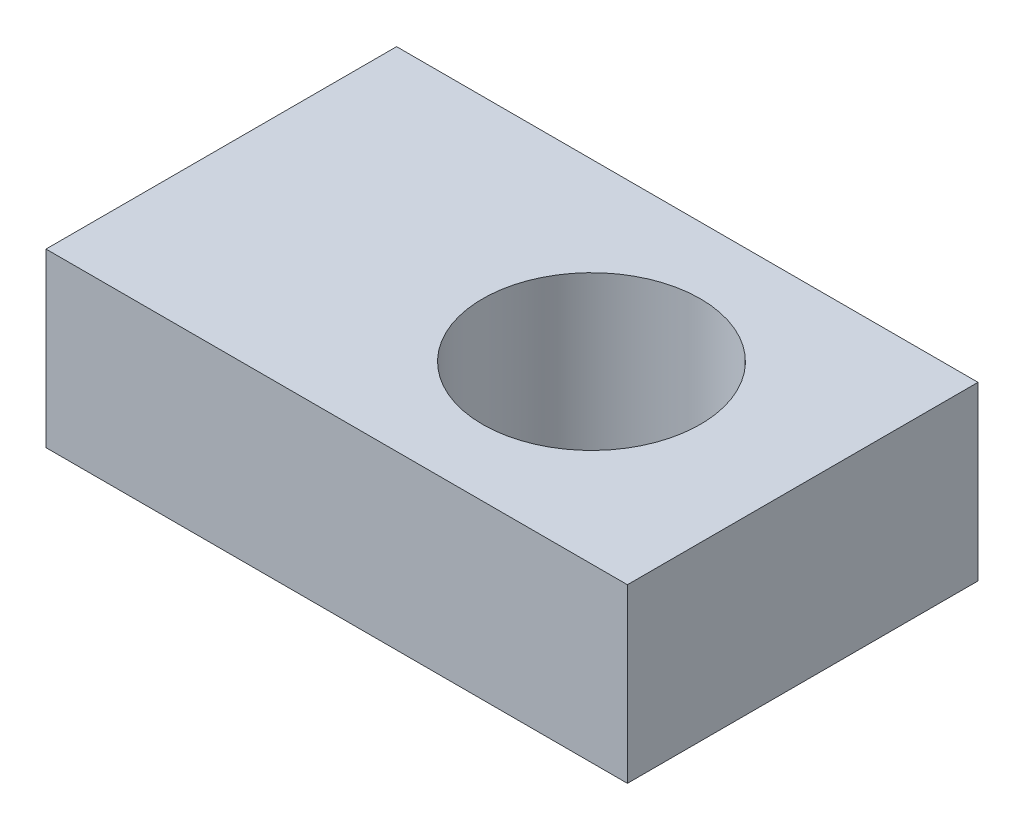
ISO-10303-21;
HEADER;
FILE_DESCRIPTION(('STEP AP214'),'2;1');
FILE_NAME('part.step','',(''),(''),'','','');
FILE_SCHEMA(('AUTOMOTIVE_DESIGN { 1 0 10303 214 1 1 1 1 }'));
ENDSEC;
DATA;
#1=APPLICATION_CONTEXT('core data for automotive mechanical design processes');
#2=APPLICATION_PROTOCOL_DEFINITION('international standard','automotive_design',2000,#1);
#3=PRODUCT_CONTEXT('',#1,'mechanical');
#4=PRODUCT('Part','Part','',(#3));
#5=PRODUCT_RELATED_PRODUCT_CATEGORY('part','',(#4));
#6=PRODUCT_DEFINITION_FORMATION('','',#4);
#7=PRODUCT_DEFINITION_CONTEXT('part definition',#1,'design');
#8=PRODUCT_DEFINITION('design','',#6,#7);
#9=PRODUCT_DEFINITION_SHAPE('','',#8);
#10=(LENGTH_UNIT() NAMED_UNIT(*) SI_UNIT(.MILLI.,.METRE.));
#11=(NAMED_UNIT(*) PLANE_ANGLE_UNIT() SI_UNIT($,.RADIAN.));
#12=(NAMED_UNIT(*) SI_UNIT($,.STERADIAN.) SOLID_ANGLE_UNIT());
#13=UNCERTAINTY_MEASURE_WITH_UNIT(LENGTH_MEASURE(1.E-05),#10,'distance_accuracy_value','');
#14=(GEOMETRIC_REPRESENTATION_CONTEXT(3) GLOBAL_UNCERTAINTY_ASSIGNED_CONTEXT((#13)) GLOBAL_UNIT_ASSIGNED_CONTEXT((#10,
#11,#12)) REPRESENTATION_CONTEXT('',''));
#15=CARTESIAN_POINT('',(0.,0.,0.));
#16=DIRECTION('',(0.,0.,1.));
#17=DIRECTION('',(1.,0.,0.));
#18=AXIS2_PLACEMENT_3D('',#15,#16,#17);
#19=CARTESIAN_POINT('',(2.77,-0.06,12.38));
#20=DIRECTION('',(0.,-1.,0.));
#21=DIRECTION('',(0.,0.,-1.));
#22=AXIS2_PLACEMENT_3D('',#19,#20,#21);
#23=PLANE('',#22);
#24=CARTESIAN_POINT('',(3.5,-0.0599999999999999,12.38));
#25=DIRECTION('',(0.,-1.,0.));
#26=DIRECTION('',(0.,0.,-1.));
#27=AXIS2_PLACEMENT_3D('',#24,#25,#26);
#28=CIRCLE('',#27,1.);
#29=CARTESIAN_POINT('',(3.5,-0.0599999999999999,11.38));
#30=VERTEX_POINT('',#29);
#31=EDGE_CURVE('E20',#30,#30,#28,.F.);
#32=ORIENTED_EDGE('',*,*,#31,.T.);
#33=EDGE_LOOP('',(#32));
#34=FACE_BOUND('',#33,.T.);
#35=DIRECTION('',(-1.,0.,0.));
#36=VECTOR('',#35,1.);
#37=CARTESIAN_POINT('',(0.1,-0.0599999999999999,10.77));
#38=LINE('',#37,#36);
#39=CARTESIAN_POINT('',(5.44,-0.06,10.77));
#40=VERTEX_POINT('',#39);
#41=CARTESIAN_POINT('',(0.1,-0.06,10.77));
#42=VERTEX_POINT('',#41);
#43=EDGE_CURVE('E69',#40,#42,#38,.T.);
#44=ORIENTED_EDGE('',*,*,#43,.F.);
#45=DIRECTION('',(0.,0.,-1.));
#46=VECTOR('',#45,1.);
#47=CARTESIAN_POINT('',(5.44,-0.0599999999999999,10.77));
#48=LINE('',#47,#46);
#49=CARTESIAN_POINT('',(5.44,-0.06,13.99));
#50=VERTEX_POINT('',#49);
#51=EDGE_CURVE('E54',#50,#40,#48,.T.);
#52=ORIENTED_EDGE('',*,*,#51,.F.);
#53=DIRECTION('',(1.,0.,0.));
#54=VECTOR('',#53,1.);
#55=CARTESIAN_POINT('',(5.44,-0.0599999999999999,13.99));
#56=LINE('',#55,#54);
#57=CARTESIAN_POINT('',(0.1,-0.06,13.99));
#58=VERTEX_POINT('',#57);
#59=EDGE_CURVE('E59',#58,#50,#56,.T.);
#60=ORIENTED_EDGE('',*,*,#59,.F.);
#61=DIRECTION('',(0.,0.,1.));
#62=VECTOR('',#61,1.);
#63=CARTESIAN_POINT('',(0.1,-0.0599999999999999,13.99));
#64=LINE('',#63,#62);
#65=EDGE_CURVE('E82',#42,#58,#64,.T.);
#66=ORIENTED_EDGE('',*,*,#65,.F.);
#67=EDGE_LOOP('',(#44,#52,#60,#66));
#68=FACE_BOUND('',#67,.T.);
#69=ADVANCED_FACE('F17',(#34,#68),#23,.T.);
#70=CARTESIAN_POINT('',(5.44,1.52,13.99));
#71=DIRECTION('',(0.,0.,1.));
#72=DIRECTION('',(1.,0.,0.));
#73=AXIS2_PLACEMENT_3D('',#70,#71,#72);
#74=PLANE('',#73);
#75=ORIENTED_EDGE('',*,*,#59,.T.);
#76=DIRECTION('',(0.,1.,0.));
#77=VECTOR('',#76,1.);
#78=CARTESIAN_POINT('',(5.44,1.52,13.99));
#79=LINE('',#78,#77);
#80=CARTESIAN_POINT('',(5.44,1.52,13.99));
#81=VERTEX_POINT('',#80);
#82=EDGE_CURVE('E61',#81,#50,#79,.F.);
#83=ORIENTED_EDGE('',*,*,#82,.F.);
#84=DIRECTION('',(1.,0.,0.));
#85=VECTOR('',#84,1.);
#86=CARTESIAN_POINT('',(2.77,1.52,13.99));
#87=LINE('',#86,#85);
#88=CARTESIAN_POINT('',(0.1,1.52,13.99));
#89=VERTEX_POINT('',#88);
#90=EDGE_CURVE('E85',#89,#81,#87,.T.);
#91=ORIENTED_EDGE('',*,*,#90,.F.);
#92=DIRECTION('',(0.,1.,0.));
#93=VECTOR('',#92,1.);
#94=CARTESIAN_POINT('',(0.1,1.52,13.99));
#95=LINE('',#94,#93);
#96=EDGE_CURVE('E64',#58,#89,#95,.T.);
#97=ORIENTED_EDGE('',*,*,#96,.F.);
#98=EDGE_LOOP('',(#75,#83,#91,#97));
#99=FACE_BOUND('',#98,.T.);
#100=ADVANCED_FACE('F60',(#99),#74,.T.);
#101=CARTESIAN_POINT('',(5.44,1.52,10.77));
#102=DIRECTION('',(1.,0.,0.));
#103=DIRECTION('',(0.,0.,-1.));
#104=AXIS2_PLACEMENT_3D('',#101,#102,#103);
#105=PLANE('',#104);
#106=ORIENTED_EDGE('',*,*,#51,.T.);
#107=DIRECTION('',(0.,1.,0.));
#108=VECTOR('',#107,1.);
#109=CARTESIAN_POINT('',(5.44,1.52,10.77));
#110=LINE('',#109,#108);
#111=CARTESIAN_POINT('',(5.44,1.52,10.77));
#112=VERTEX_POINT('',#111);
#113=EDGE_CURVE('E71',#112,#40,#110,.F.);
#114=ORIENTED_EDGE('',*,*,#113,.F.);
#115=DIRECTION('',(0.,0.,1.));
#116=VECTOR('',#115,1.);
#117=CARTESIAN_POINT('',(5.44,1.52,12.38));
#118=LINE('',#117,#116);
#119=EDGE_CURVE('E75',#81,#112,#118,.F.);
#120=ORIENTED_EDGE('',*,*,#119,.F.);
#121=ORIENTED_EDGE('',*,*,#82,.T.);
#122=EDGE_LOOP('',(#106,#114,#120,#121));
#123=FACE_BOUND('',#122,.T.);
#124=ADVANCED_FACE('F73',(#123),#105,.T.);
#125=CARTESIAN_POINT('',(0.1,1.52,10.77));
#126=DIRECTION('',(0.,0.,-1.));
#127=DIRECTION('',(-1.,0.,0.));
#128=AXIS2_PLACEMENT_3D('',#125,#126,#127);
#129=PLANE('',#128);
#130=ORIENTED_EDGE('',*,*,#43,.T.);
#131=DIRECTION('',(0.,1.,0.));
#132=VECTOR('',#131,1.);
#133=CARTESIAN_POINT('',(0.1,1.52,10.77));
#134=LINE('',#133,#132);
#135=CARTESIAN_POINT('',(0.1,1.52,10.77));
#136=VERTEX_POINT('',#135);
#137=EDGE_CURVE('E34',#136,#42,#134,.F.);
#138=ORIENTED_EDGE('',*,*,#137,.F.);
#139=DIRECTION('',(1.,0.,0.));
#140=VECTOR('',#139,1.);
#141=CARTESIAN_POINT('',(2.77,1.52,10.77));
#142=LINE('',#141,#140);
#143=EDGE_CURVE('E88',#112,#136,#142,.F.);
#144=ORIENTED_EDGE('',*,*,#143,.F.);
#145=ORIENTED_EDGE('',*,*,#113,.T.);
#146=EDGE_LOOP('',(#130,#138,#144,#145));
#147=FACE_BOUND('',#146,.T.);
#148=ADVANCED_FACE('F98',(#147),#129,.T.);
#149=CARTESIAN_POINT('',(0.1,1.52,13.99));
#150=DIRECTION('',(-1.,0.,0.));
#151=DIRECTION('',(0.,0.,1.));
#152=AXIS2_PLACEMENT_3D('',#149,#150,#151);
#153=PLANE('',#152);
#154=ORIENTED_EDGE('',*,*,#65,.T.);
#155=ORIENTED_EDGE('',*,*,#96,.T.);
#156=DIRECTION('',(0.,0.,1.));
#157=VECTOR('',#156,1.);
#158=CARTESIAN_POINT('',(0.0999999999999998,1.52,12.38));
#159=LINE('',#158,#157);
#160=EDGE_CURVE('E26',#136,#89,#159,.T.);
#161=ORIENTED_EDGE('',*,*,#160,.F.);
#162=ORIENTED_EDGE('',*,*,#137,.T.);
#163=EDGE_LOOP('',(#154,#155,#161,#162));
#164=FACE_BOUND('',#163,.T.);
#165=ADVANCED_FACE('F95',(#164),#153,.T.);
#166=CARTESIAN_POINT('',(3.5,1.52,12.38));
#167=DIRECTION('',(0.,-1.,0.));
#168=DIRECTION('',(0.,0.,-1.));
#169=AXIS2_PLACEMENT_3D('',#166,#167,#168);
#170=CYLINDRICAL_SURFACE('',#169,1.);
#171=ORIENTED_EDGE('',*,*,#31,.F.);
#172=EDGE_LOOP('',(#171));
#173=FACE_BOUND('',#172,.T.);
#174=CARTESIAN_POINT('',(3.5,1.52,12.38));
#175=DIRECTION('',(0.,-1.,0.));
#176=DIRECTION('',(0.,0.,-1.));
#177=AXIS2_PLACEMENT_3D('',#174,#175,#176);
#178=CIRCLE('',#177,1.);
#179=CARTESIAN_POINT('',(3.5,1.52,11.38));
#180=VERTEX_POINT('',#179);
#181=EDGE_CURVE('E11',#180,#180,#178,.T.);
#182=ORIENTED_EDGE('',*,*,#181,.F.);
#183=EDGE_LOOP('',(#182));
#184=FACE_BOUND('',#183,.T.);
#185=ADVANCED_FACE('F97',(#173,#184),#170,.F.);
#186=CARTESIAN_POINT('',(2.77,1.52,12.38));
#187=DIRECTION('',(0.,1.,0.));
#188=DIRECTION('',(0.,0.,1.));
#189=AXIS2_PLACEMENT_3D('',#186,#187,#188);
#190=PLANE('',#189);
#191=ORIENTED_EDGE('',*,*,#181,.T.);
#192=EDGE_LOOP('',(#191));
#193=FACE_BOUND('',#192,.T.);
#194=ORIENTED_EDGE('',*,*,#143,.T.);
#195=ORIENTED_EDGE('',*,*,#160,.T.);
#196=ORIENTED_EDGE('',*,*,#90,.T.);
#197=ORIENTED_EDGE('',*,*,#119,.T.);
#198=EDGE_LOOP('',(#194,#195,#196,#197));
#199=FACE_BOUND('',#198,.T.);
#200=ADVANCED_FACE('F93',(#193,#199),#190,.T.);
#201=CLOSED_SHELL('',(#69,#100,#124,#148,#165,#185,#200));
#202=MANIFOLD_SOLID_BREP('B1',#201);
#203=ADVANCED_BREP_SHAPE_REPRESENTATION('',(#18,#202),#14);
#204=SHAPE_DEFINITION_REPRESENTATION(#9,#203);
ENDSEC;
END-ISO-10303-21;
